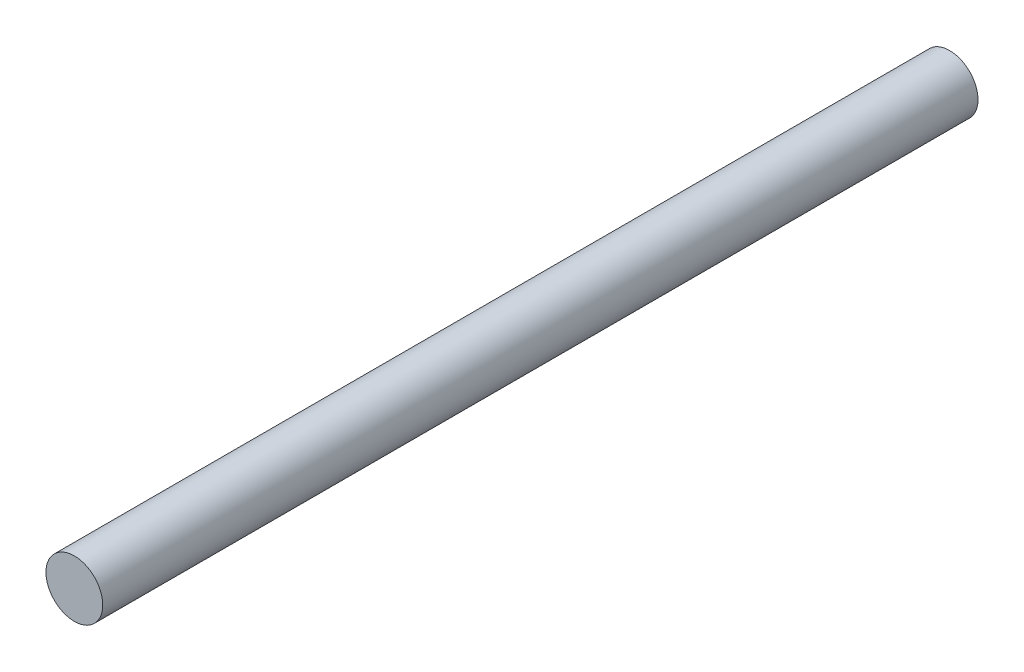
ISO-10303-21;
HEADER;
FILE_DESCRIPTION(('STEP AP214'),'2;1');
FILE_NAME('part.step','',(''),(''),'','','');
FILE_SCHEMA(('AUTOMOTIVE_DESIGN { 1 0 10303 214 1 1 1 1 }'));
ENDSEC;
DATA;
#1=APPLICATION_CONTEXT('core data for automotive mechanical design processes');
#2=APPLICATION_PROTOCOL_DEFINITION('international standard','automotive_design',2000,#1);
#3=PRODUCT_CONTEXT('',#1,'mechanical');
#4=PRODUCT('Part','Part','',(#3));
#5=PRODUCT_RELATED_PRODUCT_CATEGORY('part','',(#4));
#6=PRODUCT_DEFINITION_FORMATION('','',#4);
#7=PRODUCT_DEFINITION_CONTEXT('part definition',#1,'design');
#8=PRODUCT_DEFINITION('design','',#6,#7);
#9=PRODUCT_DEFINITION_SHAPE('','',#8);
#10=(LENGTH_UNIT() NAMED_UNIT(*) SI_UNIT(.MILLI.,.METRE.));
#11=(NAMED_UNIT(*) PLANE_ANGLE_UNIT() SI_UNIT($,.RADIAN.));
#12=(NAMED_UNIT(*) SI_UNIT($,.STERADIAN.) SOLID_ANGLE_UNIT());
#13=UNCERTAINTY_MEASURE_WITH_UNIT(LENGTH_MEASURE(1.E-05),#10,'distance_accuracy_value','');
#14=(GEOMETRIC_REPRESENTATION_CONTEXT(3) GLOBAL_UNCERTAINTY_ASSIGNED_CONTEXT((#13)) GLOBAL_UNIT_ASSIGNED_CONTEXT((#10,
#11,#12)) REPRESENTATION_CONTEXT('',''));
#15=CARTESIAN_POINT('',(0.,0.,0.));
#16=DIRECTION('',(0.,0.,1.));
#17=DIRECTION('',(1.,0.,0.));
#18=AXIS2_PLACEMENT_3D('',#15,#16,#17);
#19=CARTESIAN_POINT('',(0.,0.,185.));
#20=DIRECTION('',(0.,0.,-1.));
#21=DIRECTION('',(-1.,0.,0.));
#22=AXIS2_PLACEMENT_3D('',#19,#20,#21);
#23=CYLINDRICAL_SURFACE('',#22,6.);
#24=CARTESIAN_POINT('',(0.,0.,185.));
#25=DIRECTION('',(0.,0.,1.));
#26=DIRECTION('',(1.,0.,0.));
#27=AXIS2_PLACEMENT_3D('',#24,#25,#26);
#28=CIRCLE('',#27,6.);
#29=CARTESIAN_POINT('',(6.,0.,185.));
#30=VERTEX_POINT('',#29);
#31=EDGE_CURVE('E10',#30,#30,#28,.T.);
#32=ORIENTED_EDGE('',*,*,#31,.F.);
#33=EDGE_LOOP('',(#32));
#34=FACE_BOUND('',#33,.T.);
#35=CARTESIAN_POINT('',(0.,0.,0.));
#36=DIRECTION('',(0.,0.,1.));
#37=DIRECTION('',(1.,0.,0.));
#38=AXIS2_PLACEMENT_3D('',#35,#36,#37);
#39=CIRCLE('',#38,6.);
#40=CARTESIAN_POINT('',(6.,0.,0.));
#41=VERTEX_POINT('',#40);
#42=EDGE_CURVE('E36',#41,#41,#39,.T.);
#43=ORIENTED_EDGE('',*,*,#42,.T.);
#44=EDGE_LOOP('',(#43));
#45=FACE_BOUND('',#44,.T.);
#46=ADVANCED_FACE('F33',(#34,#45),#23,.T.);
#47=CARTESIAN_POINT('',(0.,0.,185.));
#48=DIRECTION('',(0.,0.,1.));
#49=DIRECTION('',(1.,0.,0.));
#50=AXIS2_PLACEMENT_3D('',#47,#48,#49);
#51=PLANE('',#50);
#52=ORIENTED_EDGE('',*,*,#31,.T.);
#53=EDGE_LOOP('',(#52));
#54=FACE_BOUND('',#53,.T.);
#55=ADVANCED_FACE('F48',(#54),#51,.T.);
#56=CARTESIAN_POINT('',(0.,0.,0.));
#57=DIRECTION('',(0.,0.,1.));
#58=DIRECTION('',(1.,0.,0.));
#59=AXIS2_PLACEMENT_3D('',#56,#57,#58);
#60=PLANE('',#59);
#61=ORIENTED_EDGE('',*,*,#42,.F.);
#62=EDGE_LOOP('',(#61));
#63=FACE_BOUND('',#62,.T.);
#64=ADVANCED_FACE('F46',(#63),#60,.F.);
#65=CLOSED_SHELL('',(#46,#55,#64));
#66=MANIFOLD_SOLID_BREP('B2',#65);
#67=ADVANCED_BREP_SHAPE_REPRESENTATION('',(#18,#66),#14);
#68=SHAPE_DEFINITION_REPRESENTATION(#9,#67);
ENDSEC;
END-ISO-10303-21;
